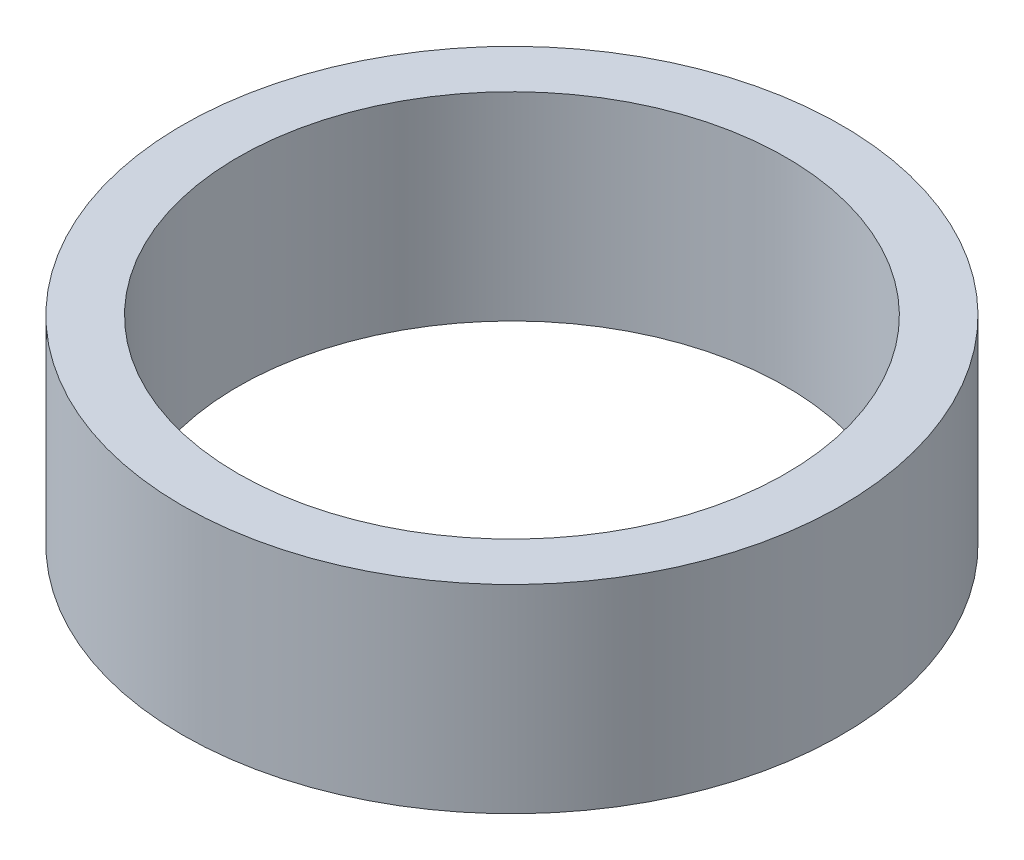
ISO-10303-21;
HEADER;
FILE_DESCRIPTION(('STEP AP214'),'2;1');
FILE_NAME('part.step','',(''),(''),'','','');
FILE_SCHEMA(('AUTOMOTIVE_DESIGN { 1 0 10303 214 1 1 1 1 }'));
ENDSEC;
DATA;
#1=APPLICATION_CONTEXT('core data for automotive mechanical design processes');
#2=APPLICATION_PROTOCOL_DEFINITION('international standard','automotive_design',2000,#1);
#3=PRODUCT_CONTEXT('',#1,'mechanical');
#4=PRODUCT('Part','Part','',(#3));
#5=PRODUCT_RELATED_PRODUCT_CATEGORY('part','',(#4));
#6=PRODUCT_DEFINITION_FORMATION('','',#4);
#7=PRODUCT_DEFINITION_CONTEXT('part definition',#1,'design');
#8=PRODUCT_DEFINITION('design','',#6,#7);
#9=PRODUCT_DEFINITION_SHAPE('','',#8);
#10=(LENGTH_UNIT() NAMED_UNIT(*) SI_UNIT(.MILLI.,.METRE.));
#11=(NAMED_UNIT(*) PLANE_ANGLE_UNIT() SI_UNIT($,.RADIAN.));
#12=(NAMED_UNIT(*) SI_UNIT($,.STERADIAN.) SOLID_ANGLE_UNIT());
#13=UNCERTAINTY_MEASURE_WITH_UNIT(LENGTH_MEASURE(1.E-05),#10,'distance_accuracy_value','');
#14=(GEOMETRIC_REPRESENTATION_CONTEXT(3) GLOBAL_UNCERTAINTY_ASSIGNED_CONTEXT((#13)) GLOBAL_UNIT_ASSIGNED_CONTEXT((#10,
#11,#12)) REPRESENTATION_CONTEXT('',''));
#15=CARTESIAN_POINT('',(0.,0.,0.));
#16=DIRECTION('',(0.,0.,1.));
#17=DIRECTION('',(1.,0.,0.));
#18=AXIS2_PLACEMENT_3D('',#15,#16,#17);
#19=CARTESIAN_POINT('',(0.,12.7,0.));
#20=DIRECTION('',(0.,1.,0.));
#21=DIRECTION('',(0.,0.,1.));
#22=AXIS2_PLACEMENT_3D('',#19,#20,#21);
#23=PLANE('',#22);
#24=CARTESIAN_POINT('',(0.,12.7,0.));
#25=DIRECTION('',(0.,1.,0.));
#26=DIRECTION('',(0.,0.,1.));
#27=AXIS2_PLACEMENT_3D('',#24,#25,#26);
#28=CIRCLE('',#27,21.082);
#29=CARTESIAN_POINT('',(0.,12.7,21.082));
#30=VERTEX_POINT('',#29);
#31=EDGE_CURVE('E10',#30,#30,#28,.T.);
#32=ORIENTED_EDGE('',*,*,#31,.T.);
#33=EDGE_LOOP('',(#32));
#34=FACE_BOUND('',#33,.T.);
#35=CARTESIAN_POINT('',(0.,12.7,0.));
#36=DIRECTION('',(0.,1.,0.));
#37=DIRECTION('',(0.,0.,1.));
#38=AXIS2_PLACEMENT_3D('',#35,#36,#37);
#39=CIRCLE('',#38,17.526);
#40=CARTESIAN_POINT('',(0.,12.7,17.526));
#41=VERTEX_POINT('',#40);
#42=EDGE_CURVE('E39',#41,#41,#39,.T.);
#43=ORIENTED_EDGE('',*,*,#42,.F.);
#44=EDGE_LOOP('',(#43));
#45=FACE_BOUND('',#44,.T.);
#46=ADVANCED_FACE('F28',(#34,#45),#23,.T.);
#47=CARTESIAN_POINT('',(0.,0.,0.));
#48=DIRECTION('',(0.,1.,0.));
#49=DIRECTION('',(0.,0.,1.));
#50=AXIS2_PLACEMENT_3D('',#47,#48,#49);
#51=PLANE('',#50);
#52=CARTESIAN_POINT('',(0.,0.,0.));
#53=DIRECTION('',(0.,1.,0.));
#54=DIRECTION('',(0.,0.,1.));
#55=AXIS2_PLACEMENT_3D('',#52,#53,#54);
#56=CIRCLE('',#55,21.082);
#57=CARTESIAN_POINT('',(0.,0.,21.082));
#58=VERTEX_POINT('',#57);
#59=EDGE_CURVE('E32',#58,#58,#56,.T.);
#60=ORIENTED_EDGE('',*,*,#59,.F.);
#61=EDGE_LOOP('',(#60));
#62=FACE_BOUND('',#61,.T.);
#63=CARTESIAN_POINT('',(0.,0.,0.));
#64=DIRECTION('',(0.,1.,0.));
#65=DIRECTION('',(0.,0.,1.));
#66=AXIS2_PLACEMENT_3D('',#63,#64,#65);
#67=CIRCLE('',#66,17.526);
#68=CARTESIAN_POINT('',(0.,0.,17.526));
#69=VERTEX_POINT('',#68);
#70=EDGE_CURVE('E41',#69,#69,#67,.T.);
#71=ORIENTED_EDGE('',*,*,#70,.T.);
#72=EDGE_LOOP('',(#71));
#73=FACE_BOUND('',#72,.T.);
#74=ADVANCED_FACE('F51',(#62,#73),#51,.F.);
#75=CARTESIAN_POINT('',(0.,12.7,0.));
#76=DIRECTION('',(0.,-1.,0.));
#77=DIRECTION('',(0.,0.,-1.));
#78=AXIS2_PLACEMENT_3D('',#75,#76,#77);
#79=CYLINDRICAL_SURFACE('',#78,21.082);
#80=ORIENTED_EDGE('',*,*,#31,.F.);
#81=EDGE_LOOP('',(#80));
#82=FACE_BOUND('',#81,.T.);
#83=ORIENTED_EDGE('',*,*,#59,.T.);
#84=EDGE_LOOP('',(#83));
#85=FACE_BOUND('',#84,.T.);
#86=ADVANCED_FACE('F30',(#82,#85),#79,.T.);
#87=CARTESIAN_POINT('',(0.,12.7,0.));
#88=DIRECTION('',(0.,-1.,0.));
#89=DIRECTION('',(0.,0.,-1.));
#90=AXIS2_PLACEMENT_3D('',#87,#88,#89);
#91=CYLINDRICAL_SURFACE('',#90,17.526);
#92=ORIENTED_EDGE('',*,*,#42,.T.);
#93=EDGE_LOOP('',(#92));
#94=FACE_BOUND('',#93,.T.);
#95=ORIENTED_EDGE('',*,*,#70,.F.);
#96=EDGE_LOOP('',(#95));
#97=FACE_BOUND('',#96,.T.);
#98=ADVANCED_FACE('F47',(#94,#97),#91,.F.);
#99=CLOSED_SHELL('',(#46,#74,#86,#98));
#100=MANIFOLD_SOLID_BREP('B2',#99);
#101=ADVANCED_BREP_SHAPE_REPRESENTATION('',(#18,#100),#14);
#102=SHAPE_DEFINITION_REPRESENTATION(#9,#101);
ENDSEC;
END-ISO-10303-21;
